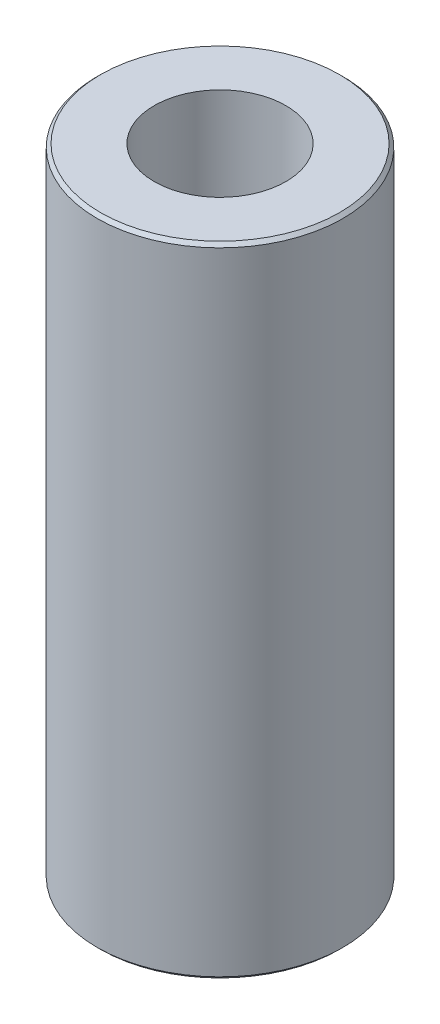
ISO-10303-21;
HEADER;
FILE_DESCRIPTION(('STEP AP214'),'2;1');
FILE_NAME('part.step','',(''),(''),'','','');
FILE_SCHEMA(('AUTOMOTIVE_DESIGN { 1 0 10303 214 1 1 1 1 }'));
ENDSEC;
DATA;
#1=APPLICATION_CONTEXT('core data for automotive mechanical design processes');
#2=APPLICATION_PROTOCOL_DEFINITION('international standard','automotive_design',2000,#1);
#3=PRODUCT_CONTEXT('',#1,'mechanical');
#4=PRODUCT('Part','Part','',(#3));
#5=PRODUCT_RELATED_PRODUCT_CATEGORY('part','',(#4));
#6=PRODUCT_DEFINITION_FORMATION('','',#4);
#7=PRODUCT_DEFINITION_CONTEXT('part definition',#1,'design');
#8=PRODUCT_DEFINITION('design','',#6,#7);
#9=PRODUCT_DEFINITION_SHAPE('','',#8);
#10=(LENGTH_UNIT() NAMED_UNIT(*) SI_UNIT(.MILLI.,.METRE.));
#11=(NAMED_UNIT(*) PLANE_ANGLE_UNIT() SI_UNIT($,.RADIAN.));
#12=(NAMED_UNIT(*) SI_UNIT($,.STERADIAN.) SOLID_ANGLE_UNIT());
#13=UNCERTAINTY_MEASURE_WITH_UNIT(LENGTH_MEASURE(1.E-05),#10,'distance_accuracy_value','');
#14=(GEOMETRIC_REPRESENTATION_CONTEXT(3) GLOBAL_UNCERTAINTY_ASSIGNED_CONTEXT((#13)) GLOBAL_UNIT_ASSIGNED_CONTEXT((#10,
#11,#12)) REPRESENTATION_CONTEXT('',''));
#15=CARTESIAN_POINT('',(0.,0.,0.));
#16=DIRECTION('',(0.,0.,1.));
#17=DIRECTION('',(1.,0.,0.));
#18=AXIS2_PLACEMENT_3D('',#15,#16,#17);
#19=CARTESIAN_POINT('',(0.,311.462752225365,0.));
#20=DIRECTION('',(0.,-1.,0.));
#21=DIRECTION('',(0.,0.,-1.));
#22=AXIS2_PLACEMENT_3D('',#19,#20,#21);
#23=CYLINDRICAL_SURFACE('',#22,60.);
#24=CARTESIAN_POINT('',(0.,309.812844088476,0.));
#25=DIRECTION('',(0.,1.,0.));
#26=DIRECTION('',(0.,0.,1.));
#27=AXIS2_PLACEMENT_3D('',#24,#25,#26);
#28=CIRCLE('',#27,60.);
#29=CARTESIAN_POINT('',(0.,309.812844088476,60.));
#30=VERTEX_POINT('',#29);
#31=EDGE_CURVE('E50',#30,#30,#28,.F.);
#32=ORIENTED_EDGE('',*,*,#31,.T.);
#33=EDGE_LOOP('',(#32));
#34=FACE_BOUND('',#33,.T.);
#35=CARTESIAN_POINT('',(0.,1.64990813688853,0.));
#36=DIRECTION('',(0.,1.,0.));
#37=DIRECTION('',(0.,0.,1.));
#38=AXIS2_PLACEMENT_3D('',#35,#36,#37);
#39=CIRCLE('',#38,60.);
#40=CARTESIAN_POINT('',(0.,1.64990813688853,60.));
#41=VERTEX_POINT('',#40);
#42=EDGE_CURVE('E51',#41,#41,#39,.T.);
#43=ORIENTED_EDGE('',*,*,#42,.T.);
#44=EDGE_LOOP('',(#43));
#45=FACE_BOUND('',#44,.T.);
#46=ADVANCED_FACE('F39',(#34,#45),#23,.T.);
#47=CARTESIAN_POINT('',(0.,311.462752225365,0.));
#48=DIRECTION('',(0.,1.,0.));
#49=DIRECTION('',(0.,0.,1.));
#50=AXIS2_PLACEMENT_3D('',#47,#48,#49);
#51=PLANE('',#50);
#52=CARTESIAN_POINT('',(0.,311.462752225365,0.));
#53=DIRECTION('',(0.,1.,0.));
#54=DIRECTION('',(0.,0.,1.));
#55=AXIS2_PLACEMENT_3D('',#52,#53,#54);
#56=CIRCLE('',#55,58.3500918631116);
#57=CARTESIAN_POINT('',(0.,311.462752225365,58.3500918631116));
#58=VERTEX_POINT('',#57);
#59=EDGE_CURVE('E54',#58,#58,#56,.T.);
#60=ORIENTED_EDGE('',*,*,#59,.T.);
#61=EDGE_LOOP('',(#60));
#62=FACE_BOUND('',#61,.T.);
#63=CARTESIAN_POINT('',(0.,311.462752225365,0.));
#64=DIRECTION('',(0.,1.,0.));
#65=DIRECTION('',(0.,0.,1.));
#66=AXIS2_PLACEMENT_3D('',#63,#64,#65);
#67=CIRCLE('',#66,32.1489449391558);
#68=CARTESIAN_POINT('',(0.,311.462752225365,32.1489449391558));
#69=VERTEX_POINT('',#68);
#70=EDGE_CURVE('E58',#69,#69,#67,.T.);
#71=ORIENTED_EDGE('',*,*,#70,.F.);
#72=EDGE_LOOP('',(#71));
#73=FACE_BOUND('',#72,.T.);
#74=ADVANCED_FACE('F69',(#62,#73),#51,.T.);
#75=CARTESIAN_POINT('',(0.,0.,0.));
#76=DIRECTION('',(0.,1.,0.));
#77=DIRECTION('',(0.,0.,1.));
#78=AXIS2_PLACEMENT_3D('',#75,#76,#77);
#79=PLANE('',#78);
#80=CARTESIAN_POINT('',(0.,0.,0.));
#81=DIRECTION('',(0.,1.,0.));
#82=DIRECTION('',(0.,0.,1.));
#83=AXIS2_PLACEMENT_3D('',#80,#81,#82);
#84=CIRCLE('',#83,58.3500918631115);
#85=CARTESIAN_POINT('',(0.,0.,58.3500918631115));
#86=VERTEX_POINT('',#85);
#87=EDGE_CURVE('E10',#86,#86,#84,.F.);
#88=ORIENTED_EDGE('',*,*,#87,.T.);
#89=EDGE_LOOP('',(#88));
#90=FACE_BOUND('',#89,.T.);
#91=CARTESIAN_POINT('',(0.,0.,0.));
#92=DIRECTION('',(0.,1.,0.));
#93=DIRECTION('',(0.,0.,1.));
#94=AXIS2_PLACEMENT_3D('',#91,#92,#93);
#95=CIRCLE('',#94,32.1489449391558);
#96=CARTESIAN_POINT('',(0.,0.,32.1489449391558));
#97=VERTEX_POINT('',#96);
#98=EDGE_CURVE('E63',#97,#97,#95,.T.);
#99=ORIENTED_EDGE('',*,*,#98,.T.);
#100=EDGE_LOOP('',(#99));
#101=FACE_BOUND('',#100,.T.);
#102=ADVANCED_FACE('F75',(#90,#101),#79,.F.);
#103=CARTESIAN_POINT('',(0.,311.462752225365,0.));
#104=DIRECTION('',(0.,-1.,0.));
#105=DIRECTION('',(0.,0.,-1.));
#106=AXIS2_PLACEMENT_3D('',#103,#104,#105);
#107=CYLINDRICAL_SURFACE('',#106,32.1489449391558);
#108=ORIENTED_EDGE('',*,*,#70,.T.);
#109=EDGE_LOOP('',(#108));
#110=FACE_BOUND('',#109,.T.);
#111=ORIENTED_EDGE('',*,*,#98,.F.);
#112=EDGE_LOOP('',(#111));
#113=FACE_BOUND('',#112,.T.);
#114=ADVANCED_FACE('F70',(#110,#113),#107,.F.);
#115=CARTESIAN_POINT('',(0.,311.462752225365,0.));
#116=DIRECTION('',(0.,-1.,0.));
#117=DIRECTION('',(0.,0.,-1.));
#118=AXIS2_PLACEMENT_3D('',#115,#116,#117);
#119=CONICAL_SURFACE('',#118,58.3500918631116,0.785398163397432);
#120=ORIENTED_EDGE('',*,*,#31,.F.);
#121=EDGE_LOOP('',(#120));
#122=FACE_BOUND('',#121,.T.);
#123=ORIENTED_EDGE('',*,*,#59,.F.);
#124=EDGE_LOOP('',(#123));
#125=FACE_BOUND('',#124,.T.);
#126=ADVANCED_FACE('F81',(#122,#125),#119,.T.);
#127=CARTESIAN_POINT('',(0.,1.64990813688853,0.));
#128=DIRECTION('',(0.,1.,0.));
#129=DIRECTION('',(0.,0.,1.));
#130=AXIS2_PLACEMENT_3D('',#127,#128,#129);
#131=CONICAL_SURFACE('',#130,60.,0.785398163397432);
#132=CARTESIAN_POINT('',(0.,0.,58.3500918631115));
#133=CARTESIAN_POINT('',(0.,0.0171865430925906,58.3672784062041));
#134=CARTESIAN_POINT('',(0.,0.0343730861851788,58.3844649492967));
#135=CARTESIAN_POINT('',(0.,0.0687461723703553,58.4188380354819));
#136=CARTESIAN_POINT('',(0.,0.0859327154629435,58.4360245785745));
#137=CARTESIAN_POINT('',(0.,0.120305801648122,58.4703976647596));
#138=CARTESIAN_POINT('',(0.,0.137492344740712,58.4875842078522));
#139=CARTESIAN_POINT('',(0.,0.171865430925889,58.5219572940374));
#140=CARTESIAN_POINT('',(0.,0.189051974018477,58.53914383713));
#141=CARTESIAN_POINT('',(0.,0.223425060203655,58.5735169233152));
#142=CARTESIAN_POINT('',(0.,0.240611603296245,58.5907034664078));
#143=CARTESIAN_POINT('',(0.,0.274984689481423,58.6250765525929));
#144=CARTESIAN_POINT('',(0.,0.29217123257401,58.6422630956855));
#145=CARTESIAN_POINT('',(0.,0.326544318759188,58.6766361818707));
#146=CARTESIAN_POINT('',(0.,0.343730861851778,58.6938227249633));
#147=CARTESIAN_POINT('',(0.,0.378103948036956,58.7281958111485));
#148=CARTESIAN_POINT('',(0.,0.395290491129544,58.7453823542411));
#149=CARTESIAN_POINT('',(0.,0.429663577314722,58.7797554404262));
#150=CARTESIAN_POINT('',(0.,0.446850120407312,58.7969419835188));
#151=CARTESIAN_POINT('',(0.,0.481223206592489,58.831315069704));
#152=CARTESIAN_POINT('',(0.,0.498409749685077,58.8485016127966));
#153=CARTESIAN_POINT('',(0.,0.532782835870255,58.8828746989818));
#154=CARTESIAN_POINT('',(0.,0.549969378962845,58.9000612420743));
#155=CARTESIAN_POINT('',(0.,0.584342465148023,58.9344343282595));
#156=CARTESIAN_POINT('',(0.,0.601529008240611,58.9516208713521));
#157=CARTESIAN_POINT('',(0.,0.635902094425788,58.9859939575373));
#158=CARTESIAN_POINT('',(0.,0.653088637518379,59.0031805006299));
#159=CARTESIAN_POINT('',(0.,0.687461723703556,59.0375535868151));
#160=CARTESIAN_POINT('',(0.,0.704648266796144,59.0547401299076));
#161=CARTESIAN_POINT('',(0.,0.739021352981322,59.0891132160928));
#162=CARTESIAN_POINT('',(0.,0.756207896073912,59.1062997591854));
#163=CARTESIAN_POINT('',(0.,0.79058098225909,59.1406728453706));
#164=CARTESIAN_POINT('',(0.,0.807767525351677,59.1578593884632));
#165=CARTESIAN_POINT('',(0.,0.842140611536855,59.1922324746483));
#166=CARTESIAN_POINT('',(0.,0.859327154629445,59.2094190177409));
#167=CARTESIAN_POINT('',(0.,0.893700240814623,59.2437921039261));
#168=CARTESIAN_POINT('',(0.,0.910886783907211,59.2609786470187));
#169=CARTESIAN_POINT('',(0.,0.945259870092389,59.2953517332039));
#170=CARTESIAN_POINT('',(0.,0.962446413184979,59.3125382762965));
#171=CARTESIAN_POINT('',(0.,0.996819499370156,59.3469113624816));
#172=CARTESIAN_POINT('',(0.,1.01400604246274,59.3640979055742));
#173=CARTESIAN_POINT('',(0.,1.04837912864792,59.3984709917594));
#174=CARTESIAN_POINT('',(0.,1.06556567174051,59.415657534852));
#175=CARTESIAN_POINT('',(0.,1.09993875792569,59.4500306210372));
#176=CARTESIAN_POINT('',(0.,1.11712530101828,59.4672171641298));
#177=CARTESIAN_POINT('',(0.,1.15149838720346,59.5015902503149));
#178=CARTESIAN_POINT('',(0.,1.16868493029605,59.5187767934075));
#179=CARTESIAN_POINT('',(0.,1.20305801648122,59.5531498795927));
#180=CARTESIAN_POINT('',(0.,1.22024455957381,59.5703364226853));
#181=CARTESIAN_POINT('',(0.,1.25461764575899,59.6047095088705));
#182=CARTESIAN_POINT('',(0.,1.27180418885158,59.6218960519631));
#183=CARTESIAN_POINT('',(0.,1.30617727503676,59.6562691381482));
#184=CARTESIAN_POINT('',(0.,1.32336381812935,59.6734556812408));
#185=CARTESIAN_POINT('',(0.,1.35773690431452,59.707828767426));
#186=CARTESIAN_POINT('',(0.,1.37492344740711,59.7250153105186));
#187=CARTESIAN_POINT('',(0.,1.40929653359229,59.7593883967038));
#188=CARTESIAN_POINT('',(0.,1.42648307668488,59.7765749397963));
#189=CARTESIAN_POINT('',(0.,1.46085616287006,59.8109480259815));
#190=CARTESIAN_POINT('',(0.,1.47804270596265,59.8281345690741));
#191=CARTESIAN_POINT('',(0.,1.51241579214782,59.8625076552593));
#192=CARTESIAN_POINT('',(0.,1.52960233524041,59.8796941983519));
#193=CARTESIAN_POINT('',(0.,1.56397542142559,59.9140672845371));
#194=CARTESIAN_POINT('',(0.,1.58116196451818,59.9312538276296));
#195=CARTESIAN_POINT('',(0.,1.61553505070336,59.9656269138148));
#196=CARTESIAN_POINT('',(0.,1.63272159379594,59.9828134569074));
#197=CARTESIAN_POINT('',(0.,1.64990813688853,60.));
#198=B_SPLINE_CURVE_WITH_KNOTS('',3,(#132,#133,#134,#135,#136,#137,#138,#139,#140,#141,#142,
#143,#144,#145,#146,#147,#148,#149,#150,#151,#152,#153,#154,#155,#156,#157,#158,#159,#160,#161,
#162,#163,#164,#165,#166,#167,#168,#169,#170,#171,#172,#173,#174,#175,#176,#177,#178,#179,#180,
#181,#182,#183,#184,#185,#186,#187,#188,#189,#190,#191,#192,#193,#194,#195,#196,#197),
.UNSPECIFIED.,.F.,.F.,(4,2,2,2,2,2,2,2,2,2,2,2,2,2,2,2,2,2,2,2,2,2,2,2,2,2,2,2,2,2,2,2,4),(0.,
0.0729163269955429,0.145832653991091,0.218748980986634,0.291665307982181,0.364581634977724,
0.437497961973272,0.510414288968815,0.583330615964363,0.656246942959905,0.729163269955453,
0.802079596950996,0.874995923946544,0.947912250942087,1.02082857793763,1.09374490493318,
1.16666123192873,1.23957755892427,1.31249388591982,1.38541021291536,1.45832653991091,
1.53124286690645,1.604159193902,1.67707552089754,1.74999184789309,1.82290817488863,
1.89582450188418,1.96874082887973,2.04165715587527,2.11457348287081,2.18748980986636,
2.26040613686191,2.33332246385745),.UNSPECIFIED.);
#199=EDGE_CURVE('BSEAM45',#86,#41,#198,.T.);
#200=ORIENTED_EDGE('',*,*,#87,.F.);
#201=ORIENTED_EDGE('',*,*,#42,.F.);
#202=ORIENTED_EDGE('',*,*,#199,.T.);
#203=ORIENTED_EDGE('',*,*,#199,.F.);
#204=EDGE_LOOP('',(#200,#202,#201,#203));
#205=FACE_BOUND('',#204,.T.);
#206=ADVANCED_FACE('F45',(#205),#131,.T.);
#207=CLOSED_SHELL('',(#46,#74,#102,#114,#126,#206));
#208=MANIFOLD_SOLID_BREP('B2',#207);
#209=ADVANCED_BREP_SHAPE_REPRESENTATION('',(#18,#208),#14);
#210=SHAPE_DEFINITION_REPRESENTATION(#9,#209);
ENDSEC;
END-ISO-10303-21;
